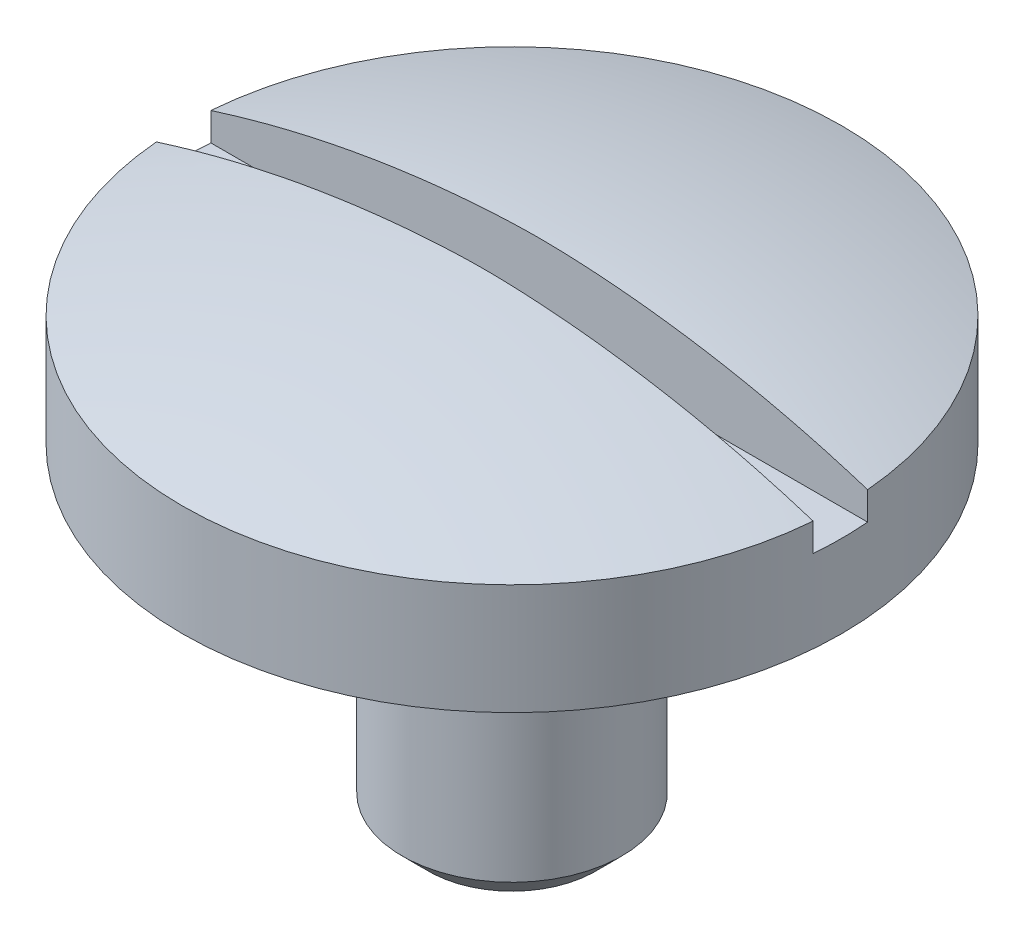
ISO-10303-21;
HEADER;
FILE_DESCRIPTION(('STEP AP214'),'2;1');
FILE_NAME('part.step','',(''),(''),'','','');
FILE_SCHEMA(('AUTOMOTIVE_DESIGN { 1 0 10303 214 1 1 1 1 }'));
ENDSEC;
DATA;
#1=APPLICATION_CONTEXT('core data for automotive mechanical design processes');
#2=APPLICATION_PROTOCOL_DEFINITION('international standard','automotive_design',2000,#1);
#3=PRODUCT_CONTEXT('',#1,'mechanical');
#4=PRODUCT('Part','Part','',(#3));
#5=PRODUCT_RELATED_PRODUCT_CATEGORY('part','',(#4));
#6=PRODUCT_DEFINITION_FORMATION('','',#4);
#7=PRODUCT_DEFINITION_CONTEXT('part definition',#1,'design');
#8=PRODUCT_DEFINITION('design','',#6,#7);
#9=PRODUCT_DEFINITION_SHAPE('','',#8);
#10=(LENGTH_UNIT() NAMED_UNIT(*) SI_UNIT(.MILLI.,.METRE.));
#11=(NAMED_UNIT(*) PLANE_ANGLE_UNIT() SI_UNIT($,.RADIAN.));
#12=(NAMED_UNIT(*) SI_UNIT($,.STERADIAN.) SOLID_ANGLE_UNIT());
#13=UNCERTAINTY_MEASURE_WITH_UNIT(LENGTH_MEASURE(1.E-05),#10,'distance_accuracy_value','');
#14=(GEOMETRIC_REPRESENTATION_CONTEXT(3) GLOBAL_UNCERTAINTY_ASSIGNED_CONTEXT((#13)) GLOBAL_UNIT_ASSIGNED_CONTEXT((#10,
#11,#12)) REPRESENTATION_CONTEXT('',''));
#15=CARTESIAN_POINT('',(0.,0.,0.));
#16=DIRECTION('',(0.,0.,1.));
#17=DIRECTION('',(1.,0.,0.));
#18=AXIS2_PLACEMENT_3D('',#15,#16,#17);
#19=CARTESIAN_POINT('',(0.,-18.9211926092492,0.));
#20=DIRECTION('',(0.,-1.,0.));
#21=DIRECTION('',(0.,0.,-1.));
#22=AXIS2_PLACEMENT_3D('',#19,#20,#21);
#23=DEGENERATE_TOROIDAL_SURFACE('',#22,0.595720644729193,33.2013374489625,.F.);
#24=CARTESIAN_POINT('',(0.,12.7,0.));
#25=DIRECTION('',(0.,-1.,0.));
#26=DIRECTION('',(0.,0.,-1.));
#27=AXIS2_PLACEMENT_3D('',#24,#25,#26);
#28=CIRCLE('',#27,9.525);
#29=CARTESIAN_POINT('',(-9.49239833972427,12.7,-0.7874));
#30=VERTEX_POINT('',#29);
#31=CARTESIAN_POINT('',(9.49239833972427,12.7,-0.7874));
#32=VERTEX_POINT('',#31);
#33=EDGE_CURVE('E90',#30,#32,#28,.T.);
#34=ORIENTED_EDGE('',*,*,#33,.F.);
#35=CARTESIAN_POINT('',(0.,14.2513229070937,-0.7874));
#36=CARTESIAN_POINT('',(-0.0656601207447611,14.2513236677576,-0.7874));
#37=CARTESIAN_POINT('',(-0.131320044490186,14.2509785016506,-0.7874));
#38=CARTESIAN_POINT('',(-0.262632424280893,14.249626171831,-0.7874));
#39=CARTESIAN_POINT('',(-0.32828488037618,14.2486190128484,-0.7874));
#40=CARTESIAN_POINT('',(-0.525229523443618,14.244700129169,-0.7874));
#41=CARTESIAN_POINT('',(-0.656504157804735,14.2408910058138,-0.7874));
#42=CARTESIAN_POINT('',(-0.919114219956072,14.2313136303293,-0.7874));
#43=CARTESIAN_POINT('',(-1.05044957210133,14.2255433737409,-0.7874));
#44=CARTESIAN_POINT('',(-1.31303221016909,14.2122501075249,-0.7874));
#45=CARTESIAN_POINT('',(-1.44427949500531,14.2047270766621,-0.7874));
#46=CARTESIAN_POINT('',(-1.83787051552675,14.1796730335238,-0.7874));
#47=CARTESIAN_POINT('',(-2.10005920824696,14.1596572320823,-0.7874));
#48=CARTESIAN_POINT('',(-2.6240728064153,14.1132526091341,-0.7874));
#49=CARTESIAN_POINT('',(-2.88589728236099,14.0868589425242,-0.7874));
#50=CARTESIAN_POINT('',(-3.40885180282977,14.0277866521006,-0.7874));
#51=CARTESIAN_POINT('',(-3.66998176653571,13.9951073267331,-0.7874));
#52=CARTESIAN_POINT('',(-4.85247781972787,13.8327359144556,-0.7874));
#53=CARTESIAN_POINT('',(-5.76922898294411,13.6671453461046,-0.7874));
#54=CARTESIAN_POINT('',(-7.58588262959175,13.2593860162027,-0.7874));
#55=CARTESIAN_POINT('',(-8.48577542260039,13.0171745609768,-0.7874));
#56=CARTESIAN_POINT('',(-10.2634228127982,12.4574902010594,-0.7874));
#57=CARTESIAN_POINT('',(-11.1411411416194,12.1399018444458,-0.7874));
#58=CARTESIAN_POINT('',(-12.8665763494944,11.4320002946951,-0.7874));
#59=CARTESIAN_POINT('',(-13.714297657327,11.0416978908624,-0.7874));
#60=CARTESIAN_POINT('',(-15.3732873526854,10.1914134855438,-0.7874));
#61=CARTESIAN_POINT('',(-16.184581165258,9.73148109516351,-0.7874));
#62=CARTESIAN_POINT('',(-17.7656307032421,8.74498014336147,-0.7874));
#63=CARTESIAN_POINT('',(-18.5353848906973,8.21840911713327,-0.7874));
#64=CARTESIAN_POINT('',(-20.027622661755,7.10256189788241,-0.7874));
#65=CARTESIAN_POINT('',(-20.7501216678809,6.51330632958526,-0.7874));
#66=CARTESIAN_POINT('',(-22.1430005872969,5.27612921310404,-0.7874));
#67=CARTESIAN_POINT('',(-22.8133809383022,4.62820815771738,-0.7874));
#68=CARTESIAN_POINT('',(-24.0983831061355,3.27712689245807,-0.7874));
#69=CARTESIAN_POINT('',(-24.7129072897827,2.57387382064965,-0.7874));
#70=CARTESIAN_POINT('',(-25.8805329585432,1.11809896252246,-0.7874));
#71=CARTESIAN_POINT('',(-26.4336342222897,0.365576998655296,-0.7874));
#72=CARTESIAN_POINT('',(-27.474498477849,-1.18341110254777,-0.7874));
#73=CARTESIAN_POINT('',(-27.9622592001614,-1.97987876491217,-0.7874));
#74=CARTESIAN_POINT('',(-28.8689519109157,-3.61107137016612,-0.7874));
#75=CARTESIAN_POINT('',(-29.2878839558257,-4.44579628166811,-0.7874));
#76=CARTESIAN_POINT('',(-30.0539469149303,-6.1475813115456,-0.7874));
#77=CARTESIAN_POINT('',(-30.4010768664935,-7.01464186325238,-0.7874));
#78=CARTESIAN_POINT('',(-31.0210609123293,-8.77492365340202,-0.7874));
#79=CARTESIAN_POINT('',(-31.2939149913136,-9.66814489722951,-0.7874));
#80=CARTESIAN_POINT('',(-31.7634115462736,-11.4744133723348,-0.7874));
#81=CARTESIAN_POINT('',(-31.9600527120275,-12.3874609441738,-0.7874));
#82=CARTESIAN_POINT('',(-32.2757188198061,-14.2268759530331,-0.7874));
#83=CARTESIAN_POINT('',(-32.3947437631659,-15.1532433898241,-0.7874));
#84=CARTESIAN_POINT('',(-32.5543333292181,-17.0127362927759,-0.7874));
#85=CARTESIAN_POINT('',(-32.5948959236787,-17.9458619330087,-0.7874));
#86=CARTESIAN_POINT('',(-32.5972662820853,-19.8122132915773,-0.7874));
#87=CARTESIAN_POINT('',(-32.559074041968,-20.7454390099183,-0.7874));
#88=CARTESIAN_POINT('',(-32.4042103893961,-22.6053058899783,-0.7874));
#89=CARTESIAN_POINT('',(-32.2875431556829,-23.5319473996471,-0.7874));
#90=CARTESIAN_POINT('',(-31.9765631553434,-25.3721083645163,-0.7874));
#91=CARTESIAN_POINT('',(-31.7822504123897,-26.2856278237173,-0.7874));
#92=CARTESIAN_POINT('',(-31.3173735279265,-28.0930009353961,-0.7874));
#93=CARTESIAN_POINT('',(-31.0468135843492,-28.9868556676323,-0.7874));
#94=CARTESIAN_POINT('',(-30.4313608037259,-30.7485982073739,-0.7874));
#95=CARTESIAN_POINT('',(-30.0864679069619,-31.6164859940173,-0.7874));
#96=CARTESIAN_POINT('',(-29.324737430479,-33.3202664424235,-0.7874));
#97=CARTESIAN_POINT('',(-28.9078879007212,-34.156153761563,-0.7874));
#98=CARTESIAN_POINT('',(-28.0052486938198,-35.7898349969471,-0.7874));
#99=CARTESIAN_POINT('',(-27.5194591859417,-36.5876290067144,-0.7874));
#100=CARTESIAN_POINT('',(-26.482316059454,-38.1395685687338,-0.7874));
#101=CARTESIAN_POINT('',(-25.9309526889476,-38.8937076039277,-0.7874));
#102=CARTESIAN_POINT('',(-24.7666353435987,-40.3528513945394,-0.7874));
#103=CARTESIAN_POINT('',(-24.1536807763403,-41.0578556772431,-0.7874));
#104=CARTESIAN_POINT('',(-22.8708434882616,-42.4133919795604,-0.7874));
#105=CARTESIAN_POINT('',(-22.2009873192381,-43.0639491273556,-0.7874));
#106=CARTESIAN_POINT('',(-20.8088846473162,-44.3063117597083,-0.7874));
#107=CARTESIAN_POINT('',(-20.0866399439024,-44.8981192605948,-0.7874));
#108=CARTESIAN_POINT('',(-18.5951393018925,-46.0186022029766,-0.7874));
#109=CARTESIAN_POINT('',(-17.8259000846153,-46.5472999043211,-0.7874));
#110=CARTESIAN_POINT('',(-16.2455407936692,-47.5381089110273,-0.7874));
#111=CARTESIAN_POINT('',(-15.4344160691406,-48.0002128002939,-0.7874));
#112=CARTESIAN_POINT('',(-13.7751772209156,-48.8549782552063,-0.7874));
#113=CARTESIAN_POINT('',(-12.9270199165065,-49.2475559022377,-0.7874));
#114=CARTESIAN_POINT('',(-11.2007810978453,-49.9597123926579,-0.7874));
#115=CARTESIAN_POINT('',(-10.3227100279221,-50.2793164204487,-0.7874));
#116=CARTESIAN_POINT('',(-9.0512823755363,-50.6822379597109,-0.7874));
#117=CARTESIAN_POINT('',(-8.66742657159085,-50.7962746372821,-0.7874));
#118=CARTESIAN_POINT('',(-7.89581190438989,-51.0103864949846,-0.7874));
#119=CARTESIAN_POINT('',(-7.50805303240418,-51.1104616438799,-0.7874));
#120=CARTESIAN_POINT('',(-6.72896030309961,-51.2965510124775,-0.7874));
#121=CARTESIAN_POINT('',(-6.33762461560428,-51.3825575528061,-0.7874));
#122=CARTESIAN_POINT('',(-5.55211623958194,-51.5403199702842,-0.7874));
#123=CARTESIAN_POINT('',(-5.15794374796918,-51.6120768268625,-0.7874));
#124=CARTESIAN_POINT('',(-4.3682530201975,-51.7410662242097,-0.7874));
#125=CARTESIAN_POINT('',(-3.97274068257046,-51.7983349280033,-0.7874));
#126=CARTESIAN_POINT('',(-3.1797977981886,-51.8984732342659,-0.7874));
#127=CARTESIAN_POINT('',(-2.78236685302664,-51.9413397029907,-0.7874));
#128=CARTESIAN_POINT('',(-2.1854328509852,-51.994610762243,-0.7874));
#129=CARTESIAN_POINT('',(-1.98640800677847,-52.0105252679858,-0.7874));
#130=CARTESIAN_POINT('',(-1.58809556367892,-52.0385893627131,-0.7874));
#131=CARTESIAN_POINT('',(-1.38880797121739,-52.050739042192,-0.7874));
#132=CARTESIAN_POINT('',(-0.990089385742745,-52.0710425366504,-0.7874));
#133=CARTESIAN_POINT('',(-0.790658461759826,-52.0791976690233,-0.7874));
#134=CARTESIAN_POINT('',(-0.491417153341291,-52.0877477313085,-0.7874));
#135=CARTESIAN_POINT('',(-0.391658862665875,-52.089983961012,-0.7874));
#136=CARTESIAN_POINT('',(-0.19212015654115,-52.0929831465851,-0.7874));
#137=CARTESIAN_POINT('',(-0.0923397414436763,-52.0937461244075,-0.7874));
#138=CARTESIAN_POINT('',(0.107465557555655,-52.0936670984717,-0.7874));
#139=CARTESIAN_POINT('',(0.207490439561412,-52.0928211453813,-0.7874));
#140=CARTESIAN_POINT('',(0.407518108586595,-52.0896642946051,-0.7874));
#141=CARTESIAN_POINT('',(0.507520895081899,-52.0873533652654,-0.7874));
#142=CARTESIAN_POINT('',(0.707500440343089,-52.0814955425928,-0.7874));
#143=CARTESIAN_POINT('',(0.807477195095717,-52.0779485148746,-0.7874));
#144=CARTESIAN_POINT('',(1.00738471456919,-52.069762717835,-0.7874));
#145=CARTESIAN_POINT('',(1.10731547952097,-52.0651239540566,-0.7874));
#146=CARTESIAN_POINT('',(1.40709592043401,-52.0496922090216,-0.7874));
#147=CARTESIAN_POINT('',(1.60686960520969,-52.0373857790436,-0.7874));
#148=CARTESIAN_POINT('',(2.00614854611267,-52.0090033664671,-0.7874));
#149=CARTESIAN_POINT('',(2.20565379561115,-51.9929272924378,-0.7874));
#150=CARTESIAN_POINT('',(2.80403068094863,-51.9391439032428,-0.7874));
#151=CARTESIAN_POINT('',(3.20241912422795,-51.8958995830364,-0.7874));
#152=CARTESIAN_POINT('',(3.99725576059387,-51.7949389181477,-0.7874));
#153=CARTESIAN_POINT('',(4.39370436218905,-51.737225767086,-0.7874));
#154=CARTESIAN_POINT('',(5.18519445943273,-51.6072861625634,-0.7874));
#155=CARTESIAN_POINT('',(5.58023031194693,-51.5350252847646,-0.7874));
#156=CARTESIAN_POINT('',(6.36744103230466,-51.3761905173782,-0.7874));
#157=CARTESIAN_POINT('',(6.75961569011271,-51.289615587842,-0.7874));
#158=CARTESIAN_POINT('',(7.54034275234594,-51.1023301864044,-0.7874));
#159=CARTESIAN_POINT('',(7.92889711484302,-51.0016278932381,-0.7874));
#160=CARTESIAN_POINT('',(8.70206849054584,-50.7862011100214,-0.7874));
#161=CARTESIAN_POINT('',(9.0866855530337,-50.6714767957139,-0.7874));
#162=CARTESIAN_POINT('',(10.3046548177718,-50.2839655288286,-0.7874));
#163=CARTESIAN_POINT('',(11.1298353543958,-49.9849322509838,-0.7874));
#164=CARTESIAN_POINT('',(12.7540406330082,-49.3224033250991,-0.7874));
#165=CARTESIAN_POINT('',(13.5530580156591,-48.9588897210407,-0.7874));
#166=CARTESIAN_POINT('',(15.1188955496873,-48.170171159771,-0.7874));
#167=CARTESIAN_POINT('',(15.8857526165384,-47.7450395773433,-0.7874));
#168=CARTESIAN_POINT('',(17.383372322868,-46.8354796367242,-0.7874));
#169=CARTESIAN_POINT('',(18.1141369386433,-46.3510545303027,-0.7874));
#170=CARTESIAN_POINT('',(19.5809633464334,-45.2927893647941,-0.7874));
#171=CARTESIAN_POINT('',(20.3143214964269,-44.71519581579,-0.7874));
#172=CARTESIAN_POINT('',(21.7298397887645,-43.5002740360247,-0.7874));
#173=CARTESIAN_POINT('',(22.4119960627211,-42.8629413000317,-0.7874));
#174=CARTESIAN_POINT('',(23.7206429947506,-41.5326675172756,-0.7874));
#175=CARTESIAN_POINT('',(24.3470975927871,-40.8396909923997,-0.7874));
#176=CARTESIAN_POINT('',(25.5393762414618,-39.4034325459787,-0.7874));
#177=CARTESIAN_POINT('',(26.1052014959212,-38.6601516237269,-0.7874));
#178=CARTESIAN_POINT('',(27.1721630006194,-37.1286298243694,-0.7874));
#179=CARTESIAN_POINT('',(27.6733053334039,-36.3403931848009,-0.7874));
#180=CARTESIAN_POINT('',(28.6074021707608,-34.7244973774932,-0.7874));
#181=CARTESIAN_POINT('',(29.0403563353454,-33.8968380132181,-0.7874));
#182=CARTESIAN_POINT('',(29.8349132685782,-32.208160373633,-0.7874));
#183=CARTESIAN_POINT('',(30.1965307654408,-31.3471490282038,-0.7874));
#184=CARTESIAN_POINT('',(30.8459554221382,-29.5977276637279,-0.7874));
#185=CARTESIAN_POINT('',(31.1337626866307,-28.7093176835326,-0.7874));
#186=CARTESIAN_POINT('',(31.6335434460611,-26.9113351446182,-0.7874));
#187=CARTESIAN_POINT('',(31.8455104254219,-26.0017607747737,-0.7874));
#188=CARTESIAN_POINT('',(32.1920693839181,-24.1679887549525,-0.7874));
#189=CARTESIAN_POINT('',(32.3266613261137,-23.2437910979946,-0.7874));
#190=CARTESIAN_POINT('',(32.5175199457641,-21.3872781616029,-0.7874));
#191=CARTESIAN_POINT('',(32.5737811674961,-20.4549623212893,-0.7874));
#192=CARTESIAN_POINT('',(32.6075607731675,-18.5889052951759,-0.7874));
#193=CARTESIAN_POINT('',(32.5850791612753,-17.6551641094516,-0.7874));
#194=CARTESIAN_POINT('',(32.4615329191009,-15.7928945864541,-0.7874));
#195=CARTESIAN_POINT('',(32.3604682479914,-14.8643662518896,-0.7874));
#196=CARTESIAN_POINT('',(32.0804743570565,-13.0191245811814,-0.7874));
#197=CARTESIAN_POINT('',(31.9015451354038,-12.1024112453151,-0.7874));
#198=CARTESIAN_POINT('',(31.4671079090108,-10.2873742848389,-0.7874));
#199=CARTESIAN_POINT('',(31.2116047074051,-9.3890495105733,-0.7874));
#200=CARTESIAN_POINT('',(30.6258318753446,-7.61711681791661,-0.7874));
#201=CARTESIAN_POINT('',(30.2955622666662,-6.7435088923266,-0.7874));
#202=CARTESIAN_POINT('',(29.5626164998686,-5.02724854234611,-0.7874));
#203=CARTESIAN_POINT('',(29.1599427362618,-4.18459509535486,-0.7874));
#204=CARTESIAN_POINT('',(28.2850432531915,-2.53620263641458,-0.7874));
#205=CARTESIAN_POINT('',(27.8128174727358,-1.73046365683776,-0.7874));
#206=CARTESIAN_POINT('',(26.8021059836157,-0.161527936166068,-0.7874));
#207=CARTESIAN_POINT('',(26.2636117827227,0.601663334237714,-0.7874));
#208=CARTESIAN_POINT('',(25.1242417850961,2.07996290971239,-0.7874));
#209=CARTESIAN_POINT('',(24.5233661769619,2.7950713601426,-0.7874));
#210=CARTESIAN_POINT('',(23.2634948994463,4.17213302514394,-0.7874));
#211=CARTESIAN_POINT('',(22.6044983714589,4.83408545417815,-0.7874));
#212=CARTESIAN_POINT('',(21.2330700844681,6.10012349898255,-0.7874));
#213=CARTESIAN_POINT('',(20.520637687661,6.70420842385742,-0.7874));
#214=CARTESIAN_POINT('',(19.0475294683952,7.85011343078353,-0.7874));
#215=CARTESIAN_POINT('',(18.28686145518,8.39194355201644,-0.7874));
#216=CARTESIAN_POINT('',(16.7226193160727,9.40957587385019,-0.7874));
#217=CARTESIAN_POINT('',(15.9190471140134,9.88538103158649,-0.7874));
#218=CARTESIAN_POINT('',(14.2744769671309,10.7677155649248,-0.7874));
#219=CARTESIAN_POINT('',(13.4334698363717,11.1742278176452,-0.7874));
#220=CARTESIAN_POINT('',(11.7200410340374,11.9149992822732,-0.7874));
#221=CARTESIAN_POINT('',(10.8476142928407,12.2492467726219,-0.7874));
#222=CARTESIAN_POINT('',(9.07797599796702,12.8429225596848,-0.7874));
#223=CARTESIAN_POINT('',(8.18077135601512,13.1023714947967,-0.7874));
#224=CARTESIAN_POINT('',(6.36803664296794,13.5446012400459,-0.7874));
#225=CARTESIAN_POINT('',(5.45251717359753,13.727425132583,-0.7874));
#226=CARTESIAN_POINT('',(4.1560888402595,13.9297712582205,-0.7874));
#227=CARTESIAN_POINT('',(3.78001886499871,13.9818491604697,-0.7874));
#228=CARTESIAN_POINT('',(3.02624712550456,14.0729844678022,-0.7874));
#229=CARTESIAN_POINT('',(2.64854527122433,14.1120411448357,-0.7874));
#230=CARTESIAN_POINT('',(2.08149349305278,14.1606261306984,-0.7874));
#231=CARTESIAN_POINT('',(1.89255641708245,14.1751462195611,-0.7874));
#232=CARTESIAN_POINT('',(1.51445331938314,14.2007755094881,-0.7874));
#233=CARTESIAN_POINT('',(1.32528730367215,14.2118847983354,-0.7874));
#234=CARTESIAN_POINT('',(0.946823113397831,14.2304622561086,-0.7874));
#235=CARTESIAN_POINT('',(0.757524988957965,14.2379314173943,-0.7874));
#236=CARTESIAN_POINT('',(0.47349360065935,14.2457731603074,-0.7874));
#237=CARTESIAN_POINT('',(0.378806244418617,14.2478267264598,-0.7874));
#238=CARTESIAN_POINT('',(0.189412455236286,14.2506010384442,-0.7874));
#239=CARTESIAN_POINT('',(0.0947060226970758,14.2513218099367,-0.7874));
#240=CARTESIAN_POINT('',(0.,14.2513229070937,-0.7874));
#241=B_SPLINE_CURVE_WITH_KNOTS('',3,(#35,#36,#37,#38,#39,#40,#41,#42,#43,#44,#45,#46,#47,#48,
#49,#50,#51,#52,#53,#54,#55,#56,#57,#58,#59,#60,#61,#62,#63,#64,#65,#66,#67,#68,#69,#70,#71,#72,
#73,#74,#75,#76,#77,#78,#79,#80,#81,#82,#83,#84,#85,#86,#87,#88,#89,#90,#91,#92,#93,#94,#95,#96,
#97,#98,#99,#100,#101,#102,#103,#104,#105,#106,#107,#108,#109,#110,#111,#112,#113,#114,#115,
#116,#117,#118,#119,#120,#121,#122,#123,#124,#125,#126,#127,#128,#129,#130,#131,#132,#133,#134,
#135,#136,#137,#138,#139,#140,#141,#142,#143,#144,#145,#146,#147,#148,#149,#150,#151,#152,#153,
#154,#155,#156,#157,#158,#159,#160,#161,#162,#163,#164,#165,#166,#167,#168,#169,#170,#171,#172,
#173,#174,#175,#176,#177,#178,#179,#180,#181,#182,#183,#184,#185,#186,#187,#188,#189,#190,#191,
#192,#193,#194,#195,#196,#197,#198,#199,#200,#201,#202,#203,#204,#205,#206,#207,#208,#209,#210,
#211,#212,#213,#214,#215,#216,#217,#218,#219,#220,#221,#222,#223,#224,#225,#226,#227,#228,#229,
#230,#231,#232,#233,#234,#235,#236,#237,#238,#239,#240),.UNSPECIFIED.,.T.,.F.,(4,2,2,2,2,2,2,2,
2,2,2,2,2,2,2,2,2,2,2,2,2,2,2,2,2,2,2,2,2,2,2,2,2,2,2,2,2,2,2,2,2,2,2,2,2,2,2,2,2,2,2,2,2,2,2,2,
2,2,2,2,2,2,2,2,2,2,2,2,2,2,2,2,2,2,2,2,2,2,2,2,2,2,2,2,2,2,2,2,2,2,2,2,2,2,2,2,2,2,2,2,2,2,4),
(0.,0.196979112816588,0.39395681821839,0.787926708824227,1.18230049007375,1.57667904951128,
2.36544880081597,3.15481965486929,3.94427866319958,6.73529409000689,9.52786743691089,
12.324745983324,15.1212098591739,17.9156905614135,20.7102746551503,23.5039420907246,
26.2975860613215,29.0960228421659,31.8944697081839,34.6930137486419,37.4915554931192,
40.2901347544589,43.0887145918315,45.8873425391282,48.6859704382813,51.4846706802889,
54.28337106669,57.0819224359472,59.8804729519802,62.6788694186741,65.4772681335654,
68.2761320342372,71.0749890630908,73.8742628490804,76.673563562509,79.4715651488499,
82.2694706725868,85.0663863952432,87.8636133508765,90.6641939019985,93.4638064606259,
94.6649181744881,95.8660325755431,97.067800434744,98.2694856637784,99.4681411668057,
100.667057313465,101.26600848753,101.86494526361,102.463684378363,102.763026148806,
103.062363458732,103.362436479787,103.66251598474,103.962628123672,104.262738738863,
104.86315243901,105.463580703367,106.665471021639,107.867096286881,109.071599108953,
110.276189479401,111.480085333981,112.683966101252,115.31401341037,117.944794269292,
120.572467743615,123.199997175828,125.997154169059,128.794522279918,131.593688356801,
134.39279884476,137.191645922525,139.990506954965,142.788789526592,145.587068130434,
148.385587081797,151.184107369207,153.982822563384,156.781537609409,159.580254109488,
162.378970675246,165.177511727075,167.976051963807,170.774499665699,173.572949821647,
176.371758970223,179.170559657332,181.969401697363,184.76827714934,187.566700620563,
190.364998715116,193.163987294261,195.963429537615,198.762098618719,201.559192031444,
202.698007643383,203.836886918712,204.405345745976,204.973789941716,205.542079083221,
205.826200819453,206.110317085425),.UNSPECIFIED.);
#242=EDGE_CURVE('E88',#32,#30,#241,.T.);
#243=ORIENTED_EDGE('',*,*,#242,.F.);
#244=EDGE_LOOP('',(#34,#243));
#245=FACE_BOUND('',#244,.T.);
#246=ADVANCED_FACE('F48',(#245),#23,.F.);
#247=CARTESIAN_POINT('',(0.,0.,0.));
#248=DIRECTION('',(0.,-1.,0.));
#249=DIRECTION('',(0.,0.,-1.));
#250=AXIS2_PLACEMENT_3D('',#247,#248,#249);
#251=PLANE('',#250);
#252=CARTESIAN_POINT('',(0.,0.,0.));
#253=DIRECTION('',(0.,-1.,0.));
#254=DIRECTION('',(0.,0.,-1.));
#255=AXIS2_PLACEMENT_3D('',#252,#253,#254);
#256=CIRCLE('',#255,2.41300000000001);
#257=CARTESIAN_POINT('',(0.,0.,-2.41300000000001));
#258=VERTEX_POINT('',#257);
#259=EDGE_CURVE('E56',#258,#258,#256,.T.);
#260=ORIENTED_EDGE('',*,*,#259,.T.);
#261=EDGE_LOOP('',(#260));
#262=FACE_BOUND('',#261,.T.);
#263=ADVANCED_FACE('F145',(#262),#251,.T.);
#264=CARTESIAN_POINT('',(0.,0.,0.));
#265=DIRECTION('',(0.,-1.,0.));
#266=DIRECTION('',(0.,0.,-1.));
#267=AXIS2_PLACEMENT_3D('',#264,#265,#266);
#268=CYLINDRICAL_SURFACE('',#267,3.175);
#269=CARTESIAN_POINT('',(0.,0.761999999999998,0.));
#270=DIRECTION('',(0.,-1.,0.));
#271=DIRECTION('',(0.,0.,-1.));
#272=AXIS2_PLACEMENT_3D('',#269,#270,#271);
#273=CIRCLE('',#272,3.175);
#274=CARTESIAN_POINT('',(0.,0.761999999999998,-3.175));
#275=VERTEX_POINT('',#274);
#276=EDGE_CURVE('E13',#275,#275,#273,.F.);
#277=ORIENTED_EDGE('',*,*,#276,.T.);
#278=EDGE_LOOP('',(#277));
#279=FACE_BOUND('',#278,.T.);
#280=CARTESIAN_POINT('',(0.,9.4996,0.));
#281=DIRECTION('',(0.,-1.,0.));
#282=DIRECTION('',(0.,0.,-1.));
#283=AXIS2_PLACEMENT_3D('',#280,#281,#282);
#284=CIRCLE('',#283,3.175);
#285=CARTESIAN_POINT('',(0.,9.4996,-3.175));
#286=VERTEX_POINT('',#285);
#287=EDGE_CURVE('E114',#286,#286,#284,.T.);
#288=ORIENTED_EDGE('',*,*,#287,.T.);
#289=EDGE_LOOP('',(#288));
#290=FACE_BOUND('',#289,.T.);
#291=ADVANCED_FACE('F149',(#279,#290),#268,.T.);
#292=CARTESIAN_POINT('',(0.,9.4996,-3.175));
#293=DIRECTION('',(0.,-1.,0.));
#294=DIRECTION('',(0.,0.,-1.));
#295=AXIS2_PLACEMENT_3D('',#292,#293,#294);
#296=PLANE('',#295);
#297=CARTESIAN_POINT('',(0.,9.4996,0.));
#298=DIRECTION('',(0.,-1.,0.));
#299=DIRECTION('',(0.,0.,-1.));
#300=AXIS2_PLACEMENT_3D('',#297,#298,#299);
#301=CIRCLE('',#300,9.525);
#302=CARTESIAN_POINT('',(0.,9.4996,-9.525));
#303=VERTEX_POINT('',#302);
#304=EDGE_CURVE('E111',#303,#303,#301,.T.);
#305=ORIENTED_EDGE('',*,*,#304,.T.);
#306=EDGE_LOOP('',(#305));
#307=FACE_BOUND('',#306,.T.);
#308=ORIENTED_EDGE('',*,*,#287,.F.);
#309=EDGE_LOOP('',(#308));
#310=FACE_BOUND('',#309,.T.);
#311=ADVANCED_FACE('F154',(#307,#310),#296,.T.);
#312=CARTESIAN_POINT('',(0.,0.,0.));
#313=DIRECTION('',(0.,-1.,0.));
#314=DIRECTION('',(0.,0.,-1.));
#315=AXIS2_PLACEMENT_3D('',#312,#313,#314);
#316=CYLINDRICAL_SURFACE('',#315,9.525);
#317=DIRECTION('',(0.,-1.,0.));
#318=VECTOR('',#317,1.);
#319=CARTESIAN_POINT('',(-9.49239833972427,0.,-0.7874));
#320=LINE('',#319,#318);
#321=CARTESIAN_POINT('',(-9.49239833972427,11.8872,-0.7874));
#322=VERTEX_POINT('',#321);
#323=EDGE_CURVE('E100',#30,#322,#320,.T.);
#324=ORIENTED_EDGE('',*,*,#323,.F.);
#325=ORIENTED_EDGE('',*,*,#33,.T.);
#326=DIRECTION('',(0.,-1.,0.));
#327=VECTOR('',#326,1.);
#328=CARTESIAN_POINT('',(9.49239833972427,0.,-0.7874));
#329=LINE('',#328,#327);
#330=CARTESIAN_POINT('',(9.49239833972427,11.8872,-0.7874));
#331=VERTEX_POINT('',#330);
#332=EDGE_CURVE('E98',#331,#32,#329,.F.);
#333=ORIENTED_EDGE('',*,*,#332,.F.);
#334=CARTESIAN_POINT('',(0.,11.8872,0.));
#335=DIRECTION('',(0.,-1.,0.));
#336=DIRECTION('',(0.,0.,-1.));
#337=AXIS2_PLACEMENT_3D('',#334,#335,#336);
#338=CIRCLE('',#337,9.525);
#339=CARTESIAN_POINT('',(9.49239833972427,11.8872,0.7874));
#340=VERTEX_POINT('',#339);
#341=EDGE_CURVE('E93',#340,#331,#338,.F.);
#342=ORIENTED_EDGE('',*,*,#341,.F.);
#343=DIRECTION('',(0.,-1.,0.));
#344=VECTOR('',#343,1.);
#345=CARTESIAN_POINT('',(9.49239833972427,0.,0.7874));
#346=LINE('',#345,#344);
#347=CARTESIAN_POINT('',(9.49239833972427,12.7,0.7874));
#348=VERTEX_POINT('',#347);
#349=EDGE_CURVE('E219',#348,#340,#346,.T.);
#350=ORIENTED_EDGE('',*,*,#349,.F.);
#351=CARTESIAN_POINT('',(-9.49239833972427,12.7,0.7874));
#352=VERTEX_POINT('',#351);
#353=EDGE_CURVE('E101',#348,#352,#28,.T.);
#354=ORIENTED_EDGE('',*,*,#353,.T.);
#355=DIRECTION('',(0.,-1.,0.));
#356=VECTOR('',#355,1.);
#357=CARTESIAN_POINT('',(-9.49239833972427,0.,0.7874));
#358=LINE('',#357,#356);
#359=CARTESIAN_POINT('',(-9.49239833972427,11.8872,0.7874));
#360=VERTEX_POINT('',#359);
#361=EDGE_CURVE('E68',#360,#352,#358,.F.);
#362=ORIENTED_EDGE('',*,*,#361,.F.);
#363=EDGE_CURVE('E63',#322,#360,#338,.F.);
#364=ORIENTED_EDGE('',*,*,#363,.F.);
#365=EDGE_LOOP('',(#324,#325,#333,#342,#350,#354,#362,#364));
#366=FACE_BOUND('',#365,.T.);
#367=ORIENTED_EDGE('',*,*,#304,.F.);
#368=EDGE_LOOP('',(#367));
#369=FACE_BOUND('',#368,.T.);
#370=ADVANCED_FACE('F96',(#366,#369),#316,.T.);
#371=ORIENTED_EDGE('',*,*,#353,.F.);
#372=CARTESIAN_POINT('',(0.,14.2513229070937,0.7874));
#373=CARTESIAN_POINT('',(0.0656601207447611,14.2513236677576,0.7874));
#374=CARTESIAN_POINT('',(0.131320044490186,14.2509785016506,0.7874));
#375=CARTESIAN_POINT('',(0.262632424280893,14.249626171831,0.7874));
#376=CARTESIAN_POINT('',(0.32828488037618,14.2486190128484,0.7874));
#377=CARTESIAN_POINT('',(0.525229523443618,14.244700129169,0.7874));
#378=CARTESIAN_POINT('',(0.656504157804735,14.2408910058138,0.7874));
#379=CARTESIAN_POINT('',(0.919114219956072,14.2313136303293,0.7874));
#380=CARTESIAN_POINT('',(1.05044957210133,14.2255433737409,0.7874));
#381=CARTESIAN_POINT('',(1.31303221016909,14.2122501075249,0.7874));
#382=CARTESIAN_POINT('',(1.44427949500531,14.2047270766621,0.7874));
#383=CARTESIAN_POINT('',(1.83787051552675,14.1796730335238,0.7874));
#384=CARTESIAN_POINT('',(2.10005920824696,14.1596572320823,0.7874));
#385=CARTESIAN_POINT('',(2.6240728064153,14.1132526091341,0.7874));
#386=CARTESIAN_POINT('',(2.88589728236099,14.0868589425242,0.7874));
#387=CARTESIAN_POINT('',(3.40885180282977,14.0277866521006,0.7874));
#388=CARTESIAN_POINT('',(3.66998176653571,13.9951073267331,0.7874));
#389=CARTESIAN_POINT('',(4.85247781972787,13.8327359144556,0.7874));
#390=CARTESIAN_POINT('',(5.76922898294411,13.6671453461046,0.7874));
#391=CARTESIAN_POINT('',(7.58588262959175,13.2593860162027,0.7874));
#392=CARTESIAN_POINT('',(8.48577542260039,13.0171745609768,0.7874));
#393=CARTESIAN_POINT('',(10.2634228127982,12.4574902010594,0.7874));
#394=CARTESIAN_POINT('',(11.1411411416194,12.1399018444458,0.7874));
#395=CARTESIAN_POINT('',(12.8665763494944,11.4320002946951,0.7874));
#396=CARTESIAN_POINT('',(13.714297657327,11.0416978908624,0.7874));
#397=CARTESIAN_POINT('',(15.3732873526854,10.1914134855438,0.7874));
#398=CARTESIAN_POINT('',(16.184581165258,9.73148109516351,0.7874));
#399=CARTESIAN_POINT('',(17.7656307032421,8.74498014336147,0.7874));
#400=CARTESIAN_POINT('',(18.5353848906973,8.21840911713327,0.7874));
#401=CARTESIAN_POINT('',(20.027622661755,7.10256189788241,0.7874));
#402=CARTESIAN_POINT('',(20.7501216678809,6.51330632958526,0.7874));
#403=CARTESIAN_POINT('',(22.1430005872969,5.27612921310404,0.7874));
#404=CARTESIAN_POINT('',(22.8133809383022,4.62820815771738,0.7874));
#405=CARTESIAN_POINT('',(24.0983831061355,3.27712689245807,0.7874));
#406=CARTESIAN_POINT('',(24.7129072897827,2.57387382064965,0.7874));
#407=CARTESIAN_POINT('',(25.8805329585432,1.11809896252246,0.7874));
#408=CARTESIAN_POINT('',(26.4336342222897,0.365576998655296,0.7874));
#409=CARTESIAN_POINT('',(27.474498477849,-1.18341110254777,0.7874));
#410=CARTESIAN_POINT('',(27.9622592001614,-1.97987876491217,0.7874));
#411=CARTESIAN_POINT('',(28.8689519109157,-3.61107137016612,0.7874));
#412=CARTESIAN_POINT('',(29.2878839558257,-4.44579628166811,0.7874));
#413=CARTESIAN_POINT('',(30.0539469149303,-6.1475813115456,0.7874));
#414=CARTESIAN_POINT('',(30.4010768664935,-7.01464186325238,0.7874));
#415=CARTESIAN_POINT('',(31.0210609123293,-8.77492365340202,0.7874));
#416=CARTESIAN_POINT('',(31.2939149913136,-9.66814489722951,0.7874));
#417=CARTESIAN_POINT('',(31.7634115462736,-11.4744133723348,0.7874));
#418=CARTESIAN_POINT('',(31.9600527120275,-12.3874609441738,0.7874));
#419=CARTESIAN_POINT('',(32.2757188198061,-14.2268759530331,0.7874));
#420=CARTESIAN_POINT('',(32.3947437631659,-15.1532433898241,0.7874));
#421=CARTESIAN_POINT('',(32.5543333292181,-17.0127362927759,0.7874));
#422=CARTESIAN_POINT('',(32.5948959236787,-17.9458619330087,0.7874));
#423=CARTESIAN_POINT('',(32.5972662820853,-19.8122132915773,0.7874));
#424=CARTESIAN_POINT('',(32.559074041968,-20.7454390099183,0.7874));
#425=CARTESIAN_POINT('',(32.4042103893961,-22.6053058899783,0.7874));
#426=CARTESIAN_POINT('',(32.2875431556829,-23.5319473996471,0.7874));
#427=CARTESIAN_POINT('',(31.9765631553434,-25.3721083645163,0.7874));
#428=CARTESIAN_POINT('',(31.7822504123897,-26.2856278237173,0.7874));
#429=CARTESIAN_POINT('',(31.3173735279265,-28.0930009353961,0.7874));
#430=CARTESIAN_POINT('',(31.0468135843492,-28.9868556676323,0.7874));
#431=CARTESIAN_POINT('',(30.4313608037259,-30.7485982073739,0.7874));
#432=CARTESIAN_POINT('',(30.0864679069619,-31.6164859940173,0.7874));
#433=CARTESIAN_POINT('',(29.324737430479,-33.3202664424235,0.7874));
#434=CARTESIAN_POINT('',(28.9078879007212,-34.156153761563,0.7874));
#435=CARTESIAN_POINT('',(28.0052486938198,-35.7898349969471,0.7874));
#436=CARTESIAN_POINT('',(27.5194591859417,-36.5876290067144,0.7874));
#437=CARTESIAN_POINT('',(26.482316059454,-38.1395685687338,0.7874));
#438=CARTESIAN_POINT('',(25.9309526889476,-38.8937076039277,0.7874));
#439=CARTESIAN_POINT('',(24.7666353435987,-40.3528513945394,0.7874));
#440=CARTESIAN_POINT('',(24.1536807763403,-41.0578556772431,0.7874));
#441=CARTESIAN_POINT('',(22.8708434882616,-42.4133919795604,0.7874));
#442=CARTESIAN_POINT('',(22.2009873192381,-43.0639491273556,0.7874));
#443=CARTESIAN_POINT('',(20.8088846473162,-44.3063117597083,0.7874));
#444=CARTESIAN_POINT('',(20.0866399439024,-44.8981192605948,0.7874));
#445=CARTESIAN_POINT('',(18.5951393018925,-46.0186022029766,0.7874));
#446=CARTESIAN_POINT('',(17.8259000846153,-46.5472999043211,0.7874));
#447=CARTESIAN_POINT('',(16.2455407936692,-47.5381089110273,0.7874));
#448=CARTESIAN_POINT('',(15.4344160691406,-48.0002128002939,0.7874));
#449=CARTESIAN_POINT('',(13.7751772209156,-48.8549782552063,0.7874));
#450=CARTESIAN_POINT('',(12.9270199165065,-49.2475559022377,0.7874));
#451=CARTESIAN_POINT('',(11.2007810978453,-49.9597123926579,0.7874));
#452=CARTESIAN_POINT('',(10.3227100279221,-50.2793164204487,0.7874));
#453=CARTESIAN_POINT('',(9.0512823755363,-50.6822379597109,0.7874));
#454=CARTESIAN_POINT('',(8.66742657159085,-50.7962746372821,0.7874));
#455=CARTESIAN_POINT('',(7.89581190438989,-51.0103864949846,0.7874));
#456=CARTESIAN_POINT('',(7.50805303240418,-51.1104616438799,0.7874));
#457=CARTESIAN_POINT('',(6.72896030309961,-51.2965510124775,0.7874));
#458=CARTESIAN_POINT('',(6.33762461560428,-51.3825575528061,0.7874));
#459=CARTESIAN_POINT('',(5.55211623958194,-51.5403199702842,0.7874));
#460=CARTESIAN_POINT('',(5.15794374796918,-51.6120768268625,0.7874));
#461=CARTESIAN_POINT('',(4.3682530201975,-51.7410662242097,0.7874));
#462=CARTESIAN_POINT('',(3.97274068257046,-51.7983349280033,0.7874));
#463=CARTESIAN_POINT('',(3.1797977981886,-51.8984732342659,0.7874));
#464=CARTESIAN_POINT('',(2.78236685302664,-51.9413397029907,0.7874));
#465=CARTESIAN_POINT('',(2.1854328509852,-51.994610762243,0.7874));
#466=CARTESIAN_POINT('',(1.98640800677847,-52.0105252679858,0.7874));
#467=CARTESIAN_POINT('',(1.58809556367892,-52.0385893627131,0.7874));
#468=CARTESIAN_POINT('',(1.38880797121739,-52.050739042192,0.7874));
#469=CARTESIAN_POINT('',(0.990089385742745,-52.0710425366504,0.7874));
#470=CARTESIAN_POINT('',(0.790658461759826,-52.0791976690233,0.7874));
#471=CARTESIAN_POINT('',(0.491417153341291,-52.0877477313085,0.7874));
#472=CARTESIAN_POINT('',(0.391658862665875,-52.089983961012,0.7874));
#473=CARTESIAN_POINT('',(0.19212015654115,-52.0929831465851,0.7874));
#474=CARTESIAN_POINT('',(0.0923397414436763,-52.0937461244075,0.7874));
#475=CARTESIAN_POINT('',(-0.107465557555655,-52.0936670984717,0.7874));
#476=CARTESIAN_POINT('',(-0.207490439561412,-52.0928211453813,0.7874));
#477=CARTESIAN_POINT('',(-0.407518108586595,-52.0896642946051,0.7874));
#478=CARTESIAN_POINT('',(-0.507520895081899,-52.0873533652654,0.7874));
#479=CARTESIAN_POINT('',(-0.707500440343089,-52.0814955425928,0.7874));
#480=CARTESIAN_POINT('',(-0.807477195095717,-52.0779485148746,0.7874));
#481=CARTESIAN_POINT('',(-1.00738471456919,-52.069762717835,0.7874));
#482=CARTESIAN_POINT('',(-1.10731547952097,-52.0651239540566,0.7874));
#483=CARTESIAN_POINT('',(-1.40709592043401,-52.0496922090216,0.7874));
#484=CARTESIAN_POINT('',(-1.60686960520969,-52.0373857790436,0.7874));
#485=CARTESIAN_POINT('',(-2.00614854611267,-52.0090033664671,0.7874));
#486=CARTESIAN_POINT('',(-2.20565379561115,-51.9929272924378,0.7874));
#487=CARTESIAN_POINT('',(-2.80403068094863,-51.9391439032428,0.7874));
#488=CARTESIAN_POINT('',(-3.20241912422795,-51.8958995830364,0.7874));
#489=CARTESIAN_POINT('',(-3.99725576059387,-51.7949389181477,0.7874));
#490=CARTESIAN_POINT('',(-4.39370436218905,-51.737225767086,0.7874));
#491=CARTESIAN_POINT('',(-5.18519445943273,-51.6072861625634,0.7874));
#492=CARTESIAN_POINT('',(-5.58023031194693,-51.5350252847646,0.7874));
#493=CARTESIAN_POINT('',(-6.36744103230466,-51.3761905173782,0.7874));
#494=CARTESIAN_POINT('',(-6.75961569011271,-51.289615587842,0.7874));
#495=CARTESIAN_POINT('',(-7.54034275234594,-51.1023301864044,0.7874));
#496=CARTESIAN_POINT('',(-7.92889711484302,-51.0016278932381,0.7874));
#497=CARTESIAN_POINT('',(-8.70206849054584,-50.7862011100214,0.7874));
#498=CARTESIAN_POINT('',(-9.0866855530337,-50.6714767957139,0.7874));
#499=CARTESIAN_POINT('',(-10.3046548177718,-50.2839655288286,0.7874));
#500=CARTESIAN_POINT('',(-11.1298353543958,-49.9849322509838,0.7874));
#501=CARTESIAN_POINT('',(-12.7540406330082,-49.3224033250991,0.7874));
#502=CARTESIAN_POINT('',(-13.5530580156591,-48.9588897210407,0.7874));
#503=CARTESIAN_POINT('',(-15.1188955496873,-48.170171159771,0.7874));
#504=CARTESIAN_POINT('',(-15.8857526165384,-47.7450395773433,0.7874));
#505=CARTESIAN_POINT('',(-17.383372322868,-46.8354796367242,0.7874));
#506=CARTESIAN_POINT('',(-18.1141369386433,-46.3510545303027,0.7874));
#507=CARTESIAN_POINT('',(-19.5809633464334,-45.2927893647941,0.7874));
#508=CARTESIAN_POINT('',(-20.3143214964269,-44.71519581579,0.7874));
#509=CARTESIAN_POINT('',(-21.7298397887645,-43.5002740360247,0.7874));
#510=CARTESIAN_POINT('',(-22.4119960627211,-42.8629413000317,0.7874));
#511=CARTESIAN_POINT('',(-23.7206429947506,-41.5326675172756,0.7874));
#512=CARTESIAN_POINT('',(-24.3470975927871,-40.8396909923997,0.7874));
#513=CARTESIAN_POINT('',(-25.5393762414618,-39.4034325459787,0.7874));
#514=CARTESIAN_POINT('',(-26.1052014959212,-38.6601516237269,0.7874));
#515=CARTESIAN_POINT('',(-27.1721630006194,-37.1286298243694,0.7874));
#516=CARTESIAN_POINT('',(-27.6733053334039,-36.3403931848009,0.7874));
#517=CARTESIAN_POINT('',(-28.6074021707608,-34.7244973774932,0.7874));
#518=CARTESIAN_POINT('',(-29.0403563353454,-33.8968380132181,0.7874));
#519=CARTESIAN_POINT('',(-29.8349132685782,-32.208160373633,0.7874));
#520=CARTESIAN_POINT('',(-30.1965307654408,-31.3471490282038,0.7874));
#521=CARTESIAN_POINT('',(-30.8459554221382,-29.5977276637279,0.7874));
#522=CARTESIAN_POINT('',(-31.1337626866307,-28.7093176835326,0.7874));
#523=CARTESIAN_POINT('',(-31.6335434460611,-26.9113351446182,0.7874));
#524=CARTESIAN_POINT('',(-31.8455104254219,-26.0017607747737,0.7874));
#525=CARTESIAN_POINT('',(-32.1920693839181,-24.1679887549525,0.7874));
#526=CARTESIAN_POINT('',(-32.3266613261137,-23.2437910979946,0.7874));
#527=CARTESIAN_POINT('',(-32.5175199457641,-21.3872781616029,0.7874));
#528=CARTESIAN_POINT('',(-32.5737811674961,-20.4549623212893,0.7874));
#529=CARTESIAN_POINT('',(-32.6075607731675,-18.5889052951759,0.7874));
#530=CARTESIAN_POINT('',(-32.5850791612753,-17.6551641094516,0.7874));
#531=CARTESIAN_POINT('',(-32.4615329191009,-15.7928945864541,0.7874));
#532=CARTESIAN_POINT('',(-32.3604682479914,-14.8643662518896,0.7874));
#533=CARTESIAN_POINT('',(-32.0804743570565,-13.0191245811814,0.7874));
#534=CARTESIAN_POINT('',(-31.9015451354038,-12.1024112453151,0.7874));
#535=CARTESIAN_POINT('',(-31.4671079090108,-10.2873742848389,0.7874));
#536=CARTESIAN_POINT('',(-31.2116047074051,-9.3890495105733,0.7874));
#537=CARTESIAN_POINT('',(-30.6258318753446,-7.61711681791661,0.7874));
#538=CARTESIAN_POINT('',(-30.2955622666662,-6.7435088923266,0.7874));
#539=CARTESIAN_POINT('',(-29.5626164998686,-5.02724854234611,0.7874));
#540=CARTESIAN_POINT('',(-29.1599427362618,-4.18459509535486,0.7874));
#541=CARTESIAN_POINT('',(-28.2850432531915,-2.53620263641458,0.7874));
#542=CARTESIAN_POINT('',(-27.8128174727358,-1.73046365683776,0.7874));
#543=CARTESIAN_POINT('',(-26.8021059836157,-0.161527936166068,0.7874));
#544=CARTESIAN_POINT('',(-26.2636117827227,0.601663334237714,0.7874));
#545=CARTESIAN_POINT('',(-25.1242417850961,2.07996290971239,0.7874));
#546=CARTESIAN_POINT('',(-24.5233661769619,2.7950713601426,0.7874));
#547=CARTESIAN_POINT('',(-23.2634948994463,4.17213302514394,0.7874));
#548=CARTESIAN_POINT('',(-22.6044983714589,4.83408545417815,0.7874));
#549=CARTESIAN_POINT('',(-21.2330700844681,6.10012349898255,0.7874));
#550=CARTESIAN_POINT('',(-20.520637687661,6.70420842385742,0.7874));
#551=CARTESIAN_POINT('',(-19.0475294683952,7.85011343078353,0.7874));
#552=CARTESIAN_POINT('',(-18.28686145518,8.39194355201644,0.7874));
#553=CARTESIAN_POINT('',(-16.7226193160727,9.40957587385019,0.7874));
#554=CARTESIAN_POINT('',(-15.9190471140134,9.88538103158649,0.7874));
#555=CARTESIAN_POINT('',(-14.2744769671309,10.7677155649248,0.7874));
#556=CARTESIAN_POINT('',(-13.4334698363717,11.1742278176452,0.7874));
#557=CARTESIAN_POINT('',(-11.7200410340374,11.9149992822732,0.7874));
#558=CARTESIAN_POINT('',(-10.8476142928407,12.2492467726219,0.7874));
#559=CARTESIAN_POINT('',(-9.07797599796702,12.8429225596848,0.7874));
#560=CARTESIAN_POINT('',(-8.18077135601512,13.1023714947967,0.7874));
#561=CARTESIAN_POINT('',(-6.36803664296794,13.5446012400459,0.7874));
#562=CARTESIAN_POINT('',(-5.45251717359753,13.727425132583,0.7874));
#563=CARTESIAN_POINT('',(-4.1560888402595,13.9297712582205,0.7874));
#564=CARTESIAN_POINT('',(-3.78001886499871,13.9818491604697,0.7874));
#565=CARTESIAN_POINT('',(-3.02624712550456,14.0729844678022,0.7874));
#566=CARTESIAN_POINT('',(-2.64854527122433,14.1120411448357,0.7874));
#567=CARTESIAN_POINT('',(-2.08149349305278,14.1606261306984,0.7874));
#568=CARTESIAN_POINT('',(-1.89255641708245,14.1751462195611,0.7874));
#569=CARTESIAN_POINT('',(-1.51445331938314,14.2007755094881,0.7874));
#570=CARTESIAN_POINT('',(-1.32528730367215,14.2118847983354,0.7874));
#571=CARTESIAN_POINT('',(-0.946823113397831,14.2304622561086,0.7874));
#572=CARTESIAN_POINT('',(-0.757524988957965,14.2379314173943,0.7874));
#573=CARTESIAN_POINT('',(-0.47349360065935,14.2457731603074,0.7874));
#574=CARTESIAN_POINT('',(-0.378806244418617,14.2478267264598,0.7874));
#575=CARTESIAN_POINT('',(-0.189412455236286,14.2506010384442,0.7874));
#576=CARTESIAN_POINT('',(-0.0947060226970758,14.2513218099367,0.7874));
#577=CARTESIAN_POINT('',(0.,14.2513229070937,0.7874));
#578=B_SPLINE_CURVE_WITH_KNOTS('',3,(#372,#373,#374,#375,#376,#377,#378,#379,#380,#381,#382,
#383,#384,#385,#386,#387,#388,#389,#390,#391,#392,#393,#394,#395,#396,#397,#398,#399,#400,#401,
#402,#403,#404,#405,#406,#407,#408,#409,#410,#411,#412,#413,#414,#415,#416,#417,#418,#419,#420,
#421,#422,#423,#424,#425,#426,#427,#428,#429,#430,#431,#432,#433,#434,#435,#436,#437,#438,#439,
#440,#441,#442,#443,#444,#445,#446,#447,#448,#449,#450,#451,#452,#453,#454,#455,#456,#457,#458,
#459,#460,#461,#462,#463,#464,#465,#466,#467,#468,#469,#470,#471,#472,#473,#474,#475,#476,#477,
#478,#479,#480,#481,#482,#483,#484,#485,#486,#487,#488,#489,#490,#491,#492,#493,#494,#495,#496,
#497,#498,#499,#500,#501,#502,#503,#504,#505,#506,#507,#508,#509,#510,#511,#512,#513,#514,#515,
#516,#517,#518,#519,#520,#521,#522,#523,#524,#525,#526,#527,#528,#529,#530,#531,#532,#533,#534,
#535,#536,#537,#538,#539,#540,#541,#542,#543,#544,#545,#546,#547,#548,#549,#550,#551,#552,#553,
#554,#555,#556,#557,#558,#559,#560,#561,#562,#563,#564,#565,#566,#567,#568,#569,#570,#571,#572,
#573,#574,#575,#576,#577),.UNSPECIFIED.,.T.,.F.,(4,2,2,2,2,2,2,2,2,2,2,2,2,2,2,2,2,2,2,2,2,2,2,
2,2,2,2,2,2,2,2,2,2,2,2,2,2,2,2,2,2,2,2,2,2,2,2,2,2,2,2,2,2,2,2,2,2,2,2,2,2,2,2,2,2,2,2,2,2,2,2,
2,2,2,2,2,2,2,2,2,2,2,2,2,2,2,2,2,2,2,2,2,2,2,2,2,2,2,2,2,2,2,4),(0.,0.196979112816588,
0.39395681821839,0.787926708824227,1.18230049007375,1.57667904951128,2.36544880081597,
3.15481965486929,3.94427866319958,6.73529409000689,9.52786743691089,12.324745983324,
15.1212098591739,17.9156905614135,20.7102746551503,23.5039420907246,26.2975860613215,
29.0960228421659,31.8944697081839,34.6930137486419,37.4915554931192,40.2901347544589,
43.0887145918315,45.8873425391282,48.6859704382813,51.4846706802889,54.28337106669,
57.0819224359472,59.8804729519802,62.6788694186741,65.4772681335654,68.2761320342372,
71.0749890630908,73.8742628490804,76.673563562509,79.4715651488499,82.2694706725868,
85.0663863952432,87.8636133508765,90.6641939019985,93.4638064606259,94.6649181744881,
95.8660325755431,97.067800434744,98.2694856637784,99.4681411668057,100.667057313465,
101.26600848753,101.86494526361,102.463684378363,102.763026148806,103.062363458732,
103.362436479787,103.66251598474,103.962628123672,104.262738738863,104.86315243901,
105.463580703367,106.665471021639,107.867096286881,109.071599108953,110.276189479401,
111.480085333981,112.683966101252,115.31401341037,117.944794269292,120.572467743615,
123.199997175828,125.997154169059,128.794522279918,131.593688356801,134.39279884476,
137.191645922525,139.990506954965,142.788789526592,145.587068130434,148.385587081797,
151.184107369207,153.982822563384,156.781537609409,159.580254109488,162.378970675246,
165.177511727075,167.976051963807,170.774499665699,173.572949821647,176.371758970223,
179.170559657332,181.969401697363,184.76827714934,187.566700620563,190.364998715116,
193.163987294261,195.963429537615,198.762098618719,201.559192031444,202.698007643383,
203.836886918712,204.405345745976,204.973789941716,205.542079083221,205.826200819453,
206.110317085425),.UNSPECIFIED.);
#579=EDGE_CURVE('E94',#352,#348,#578,.T.);
#580=ORIENTED_EDGE('',*,*,#579,.F.);
#581=EDGE_LOOP('',(#371,#580));
#582=FACE_BOUND('',#581,.T.);
#583=ADVANCED_FACE('F127',(#582),#23,.F.);
#584=CARTESIAN_POINT('',(38.1111637811023,11.8872,-0.7874));
#585=DIRECTION('',(0.,0.,-1.));
#586=DIRECTION('',(-1.,0.,0.));
#587=AXIS2_PLACEMENT_3D('',#584,#585,#586);
#588=PLANE('',#587);
#589=DIRECTION('',(-1.,0.,0.));
#590=VECTOR('',#589,1.);
#591=CARTESIAN_POINT('',(38.1111637811023,11.8872,-0.7874));
#592=LINE('',#591,#590);
#593=EDGE_CURVE('E106',#331,#322,#592,.T.);
#594=ORIENTED_EDGE('',*,*,#593,.F.);
#595=ORIENTED_EDGE('',*,*,#332,.T.);
#596=ORIENTED_EDGE('',*,*,#242,.T.);
#597=ORIENTED_EDGE('',*,*,#323,.T.);
#598=EDGE_LOOP('',(#594,#595,#596,#597));
#599=FACE_BOUND('',#598,.T.);
#600=ADVANCED_FACE('F104',(#599),#588,.F.);
#601=CARTESIAN_POINT('',(38.1111637811023,11.8872,0.7874));
#602=DIRECTION('',(0.,-1.,0.));
#603=DIRECTION('',(0.,0.,-1.));
#604=AXIS2_PLACEMENT_3D('',#601,#602,#603);
#605=PLANE('',#604);
#606=ORIENTED_EDGE('',*,*,#593,.T.);
#607=ORIENTED_EDGE('',*,*,#363,.T.);
#608=DIRECTION('',(-1.,0.,0.));
#609=VECTOR('',#608,1.);
#610=CARTESIAN_POINT('',(38.1111637811023,11.8872,0.7874));
#611=LINE('',#610,#609);
#612=EDGE_CURVE('E216',#340,#360,#611,.T.);
#613=ORIENTED_EDGE('',*,*,#612,.F.);
#614=ORIENTED_EDGE('',*,*,#341,.T.);
#615=EDGE_LOOP('',(#606,#607,#613,#614));
#616=FACE_BOUND('',#615,.T.);
#617=ADVANCED_FACE('F134',(#616),#605,.F.);
#618=CARTESIAN_POINT('',(38.1111637811023,11.8872,0.7874));
#619=DIRECTION('',(0.,0.,1.));
#620=DIRECTION('',(1.,0.,0.));
#621=AXIS2_PLACEMENT_3D('',#618,#619,#620);
#622=PLANE('',#621);
#623=ORIENTED_EDGE('',*,*,#612,.T.);
#624=ORIENTED_EDGE('',*,*,#361,.T.);
#625=ORIENTED_EDGE('',*,*,#579,.T.);
#626=ORIENTED_EDGE('',*,*,#349,.T.);
#627=EDGE_LOOP('',(#623,#624,#625,#626));
#628=FACE_BOUND('',#627,.T.);
#629=ADVANCED_FACE('F130',(#628),#622,.F.);
#630=CARTESIAN_POINT('',(0.,0.,0.));
#631=DIRECTION('',(0.,1.,0.));
#632=DIRECTION('',(0.,0.,1.));
#633=AXIS2_PLACEMENT_3D('',#630,#631,#632);
#634=CONICAL_SURFACE('',#633,2.41300000000001,0.785398163397443);
#635=ORIENTED_EDGE('',*,*,#276,.F.);
#636=EDGE_LOOP('',(#635));
#637=FACE_BOUND('',#636,.T.);
#638=ORIENTED_EDGE('',*,*,#259,.F.);
#639=EDGE_LOOP('',(#638));
#640=FACE_BOUND('',#639,.T.);
#641=ADVANCED_FACE('F50',(#637,#640),#634,.T.);
#642=CLOSED_SHELL('',(#246,#263,#291,#311,#370,#583,#600,#617,#629,#641));
#643=MANIFOLD_SOLID_BREP('B2',#642);
#644=ADVANCED_BREP_SHAPE_REPRESENTATION('',(#18,#643),#14);
#645=SHAPE_DEFINITION_REPRESENTATION(#9,#644);
ENDSEC;
END-ISO-10303-21;
